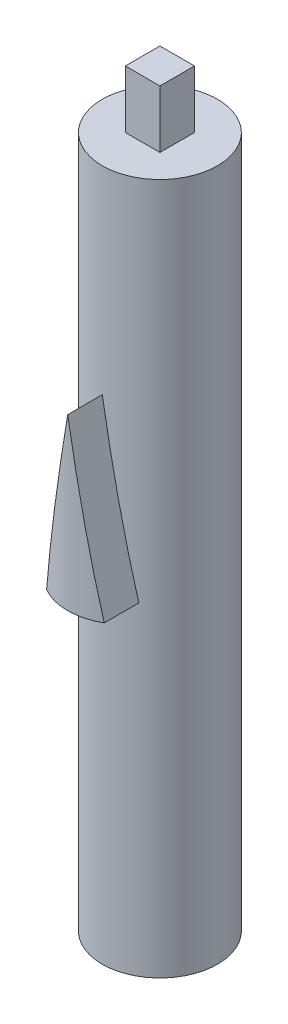
ISO-10303-21;
HEADER;
FILE_DESCRIPTION(('STEP AP214'),'2;1');
FILE_NAME('part.step','',(''),(''),'','','');
FILE_SCHEMA(('AUTOMOTIVE_DESIGN { 1 0 10303 214 1 1 1 1 }'));
ENDSEC;
DATA;
#1=APPLICATION_CONTEXT('core data for automotive mechanical design processes');
#2=APPLICATION_PROTOCOL_DEFINITION('international standard','automotive_design',2000,#1);
#3=PRODUCT_CONTEXT('',#1,'mechanical');
#4=PRODUCT('Part','Part','',(#3));
#5=PRODUCT_RELATED_PRODUCT_CATEGORY('part','',(#4));
#6=PRODUCT_DEFINITION_FORMATION('','',#4);
#7=PRODUCT_DEFINITION_CONTEXT('part definition',#1,'design');
#8=PRODUCT_DEFINITION('design','',#6,#7);
#9=PRODUCT_DEFINITION_SHAPE('','',#8);
#10=(LENGTH_UNIT() NAMED_UNIT(*) SI_UNIT(.MILLI.,.METRE.));
#11=(NAMED_UNIT(*) PLANE_ANGLE_UNIT() SI_UNIT($,.RADIAN.));
#12=(NAMED_UNIT(*) SI_UNIT($,.STERADIAN.) SOLID_ANGLE_UNIT());
#13=UNCERTAINTY_MEASURE_WITH_UNIT(LENGTH_MEASURE(1.E-05),#10,'distance_accuracy_value','');
#14=(GEOMETRIC_REPRESENTATION_CONTEXT(3) GLOBAL_UNCERTAINTY_ASSIGNED_CONTEXT((#13)) GLOBAL_UNIT_ASSIGNED_CONTEXT((#10,
#11,#12)) REPRESENTATION_CONTEXT('',''));
#15=CARTESIAN_POINT('',(0.,0.,0.));
#16=DIRECTION('',(0.,0.,1.));
#17=DIRECTION('',(1.,0.,0.));
#18=AXIS2_PLACEMENT_3D('',#15,#16,#17);
#19=CARTESIAN_POINT('',(0.,60.,0.));
#20=DIRECTION('',(0.,1.,0.));
#21=DIRECTION('',(0.,0.,1.));
#22=AXIS2_PLACEMENT_3D('',#19,#20,#21);
#23=PLANE('',#22);
#24=CARTESIAN_POINT('',(0.,60.,0.));
#25=DIRECTION('',(0.,1.,0.));
#26=DIRECTION('',(0.,0.,1.));
#27=AXIS2_PLACEMENT_3D('',#24,#25,#26);
#28=CIRCLE('',#27,5.);
#29=CARTESIAN_POINT('',(0.,60.,5.));
#30=VERTEX_POINT('',#29);
#31=EDGE_CURVE('E11',#30,#30,#28,.T.);
#32=ORIENTED_EDGE('',*,*,#31,.T.);
#33=EDGE_LOOP('',(#32));
#34=FACE_BOUND('',#33,.T.);
#35=DIRECTION('',(1.,0.,0.));
#36=VECTOR('',#35,1.);
#37=CARTESIAN_POINT('',(-1.5,60.,1.5));
#38=LINE('',#37,#36);
#39=CARTESIAN_POINT('',(-1.5,60.,1.5));
#40=VERTEX_POINT('',#39);
#41=CARTESIAN_POINT('',(1.5,60.,1.5));
#42=VERTEX_POINT('',#41);
#43=EDGE_CURVE('E454',#40,#42,#38,.T.);
#44=ORIENTED_EDGE('',*,*,#43,.F.);
#45=DIRECTION('',(0.,0.,1.));
#46=VECTOR('',#45,1.);
#47=CARTESIAN_POINT('',(-1.5,60.,-1.5));
#48=LINE('',#47,#46);
#49=CARTESIAN_POINT('',(-1.5,60.,-1.5));
#50=VERTEX_POINT('',#49);
#51=EDGE_CURVE('E144',#50,#40,#48,.T.);
#52=ORIENTED_EDGE('',*,*,#51,.F.);
#53=DIRECTION('',(-1.,0.,0.));
#54=VECTOR('',#53,1.);
#55=CARTESIAN_POINT('',(-1.5,60.,-1.5));
#56=LINE('',#55,#54);
#57=CARTESIAN_POINT('',(1.5,60.,-1.5));
#58=VERTEX_POINT('',#57);
#59=EDGE_CURVE('E140',#58,#50,#56,.T.);
#60=ORIENTED_EDGE('',*,*,#59,.F.);
#61=DIRECTION('',(0.,0.,-1.));
#62=VECTOR('',#61,1.);
#63=CARTESIAN_POINT('',(1.5,60.,-1.5));
#64=LINE('',#63,#62);
#65=EDGE_CURVE('E451',#42,#58,#64,.T.);
#66=ORIENTED_EDGE('',*,*,#65,.F.);
#67=EDGE_LOOP('',(#44,#52,#60,#66));
#68=FACE_BOUND('',#67,.T.);
#69=ADVANCED_FACE('F33',(#34,#68),#23,.T.);
#70=CARTESIAN_POINT('',(0.,60.,0.));
#71=DIRECTION('',(0.,-1.,0.));
#72=DIRECTION('',(0.,0.,-1.));
#73=AXIS2_PLACEMENT_3D('',#70,#71,#72);
#74=CYLINDRICAL_SURFACE('',#73,5.);
#75=CARTESIAN_POINT('',(2.5,28.0658588516965,4.3301270189222));
#76=CARTESIAN_POINT('',(2.21745255142468,29.730894238097,4.493255864416));
#77=CARTESIAN_POINT('',(1.91601823639988,31.5072288102985,4.61831940404549));
#78=CARTESIAN_POINT('',(1.6120982113092,33.2982115247533,4.74441425193631));
#79=CARTESIAN_POINT('',(1.2940952255126,35.1721842928747,4.82962913144534));
#80=CARTESIAN_POINT('',(0.976268591219955,37.0451178320242,4.91479675425292));
#81=CARTESIAN_POINT('',(0.649839235186189,38.968746701075,4.95759104489395));
#82=CARTESIAN_POINT('',(0.326349169152357,40.8750545081751,5.));
#83=CARTESIAN_POINT('',(0.,42.7982108406813,5.));
#84=B_SPLINE_CURVE_WITH_KNOTS('',2,(#75,#76,#77,#78,#79,#80,#81,#82,#83),.UNSPECIFIED.,.F.,.F.,
(3,2,2,2,3),(0.,0.25,0.5,0.75,1.),.UNSPECIFIED.);
#85=CARTESIAN_POINT('',(2.5,28.0658588516965,4.33012701892219));
#86=VERTEX_POINT('',#85);
#87=CARTESIAN_POINT('',(0.,42.7982108406813,5.));
#88=VERTEX_POINT('',#87);
#89=EDGE_CURVE('E171',#86,#88,#84,.T.);
#90=ORIENTED_EDGE('',*,*,#89,.F.);
#91=CARTESIAN_POINT('',(0.,28.0658588516965,0.));
#92=DIRECTION('',(0.,1.,0.));
#93=DIRECTION('',(0.,0.,1.));
#94=AXIS2_PLACEMENT_3D('',#91,#92,#93);
#95=CIRCLE('',#94,5.);
#96=CARTESIAN_POINT('',(-2.5,28.0658588516965,4.3301270189222));
#97=VERTEX_POINT('',#96);
#98=EDGE_CURVE('E60',#97,#86,#95,.T.);
#99=ORIENTED_EDGE('',*,*,#98,.F.);
#100=CARTESIAN_POINT('',(0.,42.7982108406813,5.));
#101=CARTESIAN_POINT('',(-0.326257690966926,40.875593583706,5.));
#102=CARTESIAN_POINT('',(-0.649839235186196,38.968746701075,4.95759104489394));
#103=CARTESIAN_POINT('',(-0.976089121549473,37.046175436167,4.91483237391498));
#104=CARTESIAN_POINT('',(-1.29409522551261,35.1721842928747,4.82962913144534));
#105=CARTESIAN_POINT('',(-1.61192497621431,33.2992323889112,4.7444731392313));
#106=CARTESIAN_POINT('',(-1.91601823639988,31.5072288102985,4.61831940404549));
#107=CARTESIAN_POINT('',(-2.21737332901909,29.7313610910428,4.49330160349319));
#108=CARTESIAN_POINT('',(-2.5,28.0658588516965,4.3301270189222));
#109=B_SPLINE_CURVE_WITH_KNOTS('',2,(#100,#101,#102,#103,#104,#105,#106,#107,#108),
.UNSPECIFIED.,.F.,.F.,(3,2,2,2,3),(0.,0.25,0.5,0.75,1.),.UNSPECIFIED.);
#110=EDGE_CURVE('E164',#88,#97,#109,.T.);
#111=ORIENTED_EDGE('',*,*,#110,.F.);
#112=EDGE_LOOP('',(#90,#99,#111));
#113=FACE_BOUND('',#112,.T.);
#114=ORIENTED_EDGE('',*,*,#31,.F.);
#115=EDGE_LOOP('',(#114));
#116=FACE_BOUND('',#115,.T.);
#117=CARTESIAN_POINT('',(0.,0.,0.));
#118=DIRECTION('',(0.,1.,0.));
#119=DIRECTION('',(0.,0.,1.));
#120=AXIS2_PLACEMENT_3D('',#117,#118,#119);
#121=CIRCLE('',#120,5.);
#122=CARTESIAN_POINT('',(0.,0.,5.));
#123=VERTEX_POINT('',#122);
#124=EDGE_CURVE('E44',#123,#123,#121,.T.);
#125=ORIENTED_EDGE('',*,*,#124,.T.);
#126=EDGE_LOOP('',(#125));
#127=FACE_BOUND('',#126,.T.);
#128=ADVANCED_FACE('F35',(#113,#116,#127),#74,.T.);
#129=CARTESIAN_POINT('',(0.,0.,0.));
#130=DIRECTION('',(0.,1.,0.));
#131=DIRECTION('',(0.,0.,1.));
#132=AXIS2_PLACEMENT_3D('',#129,#130,#131);
#133=PLANE('',#132);
#134=DIRECTION('',(1.,0.,0.));
#135=VECTOR('',#134,1.);
#136=CARTESIAN_POINT('',(-2.5,0.,-1.5));
#137=LINE('',#136,#135);
#138=CARTESIAN_POINT('',(-2.5,0.,-1.5));
#139=VERTEX_POINT('',#138);
#140=CARTESIAN_POINT('',(2.5,0.,-1.5));
#141=VERTEX_POINT('',#140);
#142=EDGE_CURVE('E273',#139,#141,#137,.T.);
#143=ORIENTED_EDGE('',*,*,#142,.F.);
#144=DIRECTION('',(0.,0.,-1.));
#145=VECTOR('',#144,1.);
#146=CARTESIAN_POINT('',(-2.5,0.,1.5));
#147=LINE('',#146,#145);
#148=CARTESIAN_POINT('',(-2.5,0.,1.5));
#149=VERTEX_POINT('',#148);
#150=EDGE_CURVE('E244',#149,#139,#147,.T.);
#151=ORIENTED_EDGE('',*,*,#150,.F.);
#152=DIRECTION('',(-1.,0.,0.));
#153=VECTOR('',#152,1.);
#154=CARTESIAN_POINT('',(-2.5,0.,1.5));
#155=LINE('',#154,#153);
#156=CARTESIAN_POINT('',(2.5,0.,1.5));
#157=VERTEX_POINT('',#156);
#158=EDGE_CURVE('E266',#157,#149,#155,.T.);
#159=ORIENTED_EDGE('',*,*,#158,.F.);
#160=DIRECTION('',(0.,0.,1.));
#161=VECTOR('',#160,1.);
#162=CARTESIAN_POINT('',(2.5,0.,1.5));
#163=LINE('',#162,#161);
#164=EDGE_CURVE('E270',#141,#157,#163,.T.);
#165=ORIENTED_EDGE('',*,*,#164,.F.);
#166=EDGE_LOOP('',(#143,#151,#159,#165));
#167=FACE_BOUND('',#166,.T.);
#168=ORIENTED_EDGE('',*,*,#124,.F.);
#169=EDGE_LOOP('',(#168));
#170=FACE_BOUND('',#169,.T.);
#171=ADVANCED_FACE('F311',(#167,#170),#133,.F.);
#172=CARTESIAN_POINT('',(-2.5,6.,1.5));
#173=DIRECTION('',(-1.,0.,0.));
#174=DIRECTION('',(0.,0.,1.));
#175=AXIS2_PLACEMENT_3D('',#172,#173,#174);
#176=PLANE('',#175);
#177=ORIENTED_EDGE('',*,*,#150,.T.);
#178=DIRECTION('',(0.,-1.,0.));
#179=VECTOR('',#178,1.);
#180=CARTESIAN_POINT('',(-2.5,6.,-1.5));
#181=LINE('',#180,#179);
#182=CARTESIAN_POINT('',(-2.5,6.,-1.5));
#183=VERTEX_POINT('',#182);
#184=EDGE_CURVE('E257',#183,#139,#181,.T.);
#185=ORIENTED_EDGE('',*,*,#184,.F.);
#186=DIRECTION('',(0.,0.,-1.));
#187=VECTOR('',#186,1.);
#188=CARTESIAN_POINT('',(-2.5,6.,1.5));
#189=LINE('',#188,#187);
#190=CARTESIAN_POINT('',(-2.5,6.,1.5));
#191=VERTEX_POINT('',#190);
#192=EDGE_CURVE('E269',#191,#183,#189,.T.);
#193=ORIENTED_EDGE('',*,*,#192,.F.);
#194=DIRECTION('',(0.,-1.,0.));
#195=VECTOR('',#194,1.);
#196=CARTESIAN_POINT('',(-2.5,6.,1.5));
#197=LINE('',#196,#195);
#198=EDGE_CURVE('E255',#191,#149,#197,.T.);
#199=ORIENTED_EDGE('',*,*,#198,.T.);
#200=EDGE_LOOP('',(#177,#185,#193,#199));
#201=FACE_BOUND('',#200,.T.);
#202=ADVANCED_FACE('F298',(#201),#176,.F.);
#203=CARTESIAN_POINT('',(-2.5,6.,1.5));
#204=DIRECTION('',(0.,0.,1.));
#205=DIRECTION('',(1.,0.,0.));
#206=AXIS2_PLACEMENT_3D('',#203,#204,#205);
#207=PLANE('',#206);
#208=ORIENTED_EDGE('',*,*,#158,.T.);
#209=ORIENTED_EDGE('',*,*,#198,.F.);
#210=DIRECTION('',(-1.,0.,0.));
#211=VECTOR('',#210,1.);
#212=CARTESIAN_POINT('',(-2.5,6.,1.5));
#213=LINE('',#212,#211);
#214=CARTESIAN_POINT('',(2.5,6.,1.5));
#215=VERTEX_POINT('',#214);
#216=EDGE_CURVE('E261',#215,#191,#213,.T.);
#217=ORIENTED_EDGE('',*,*,#216,.F.);
#218=DIRECTION('',(0.,-1.,0.));
#219=VECTOR('',#218,1.);
#220=CARTESIAN_POINT('',(2.5,6.,1.5));
#221=LINE('',#220,#219);
#222=EDGE_CURVE('E263',#215,#157,#221,.T.);
#223=ORIENTED_EDGE('',*,*,#222,.T.);
#224=EDGE_LOOP('',(#208,#209,#217,#223));
#225=FACE_BOUND('',#224,.T.);
#226=ADVANCED_FACE('F308',(#225),#207,.F.);
#227=CARTESIAN_POINT('',(2.5,6.,1.5));
#228=DIRECTION('',(1.,0.,0.));
#229=DIRECTION('',(0.,0.,-1.));
#230=AXIS2_PLACEMENT_3D('',#227,#228,#229);
#231=PLANE('',#230);
#232=ORIENTED_EDGE('',*,*,#164,.T.);
#233=ORIENTED_EDGE('',*,*,#222,.F.);
#234=DIRECTION('',(0.,0.,1.));
#235=VECTOR('',#234,1.);
#236=CARTESIAN_POINT('',(2.5,6.,1.5));
#237=LINE('',#236,#235);
#238=CARTESIAN_POINT('',(2.5,6.,-1.5));
#239=VERTEX_POINT('',#238);
#240=EDGE_CURVE('E279',#239,#215,#237,.T.);
#241=ORIENTED_EDGE('',*,*,#240,.F.);
#242=DIRECTION('',(0.,-1.,0.));
#243=VECTOR('',#242,1.);
#244=CARTESIAN_POINT('',(2.5,6.,-1.5));
#245=LINE('',#244,#243);
#246=EDGE_CURVE('E260',#239,#141,#245,.T.);
#247=ORIENTED_EDGE('',*,*,#246,.T.);
#248=EDGE_LOOP('',(#232,#233,#241,#247));
#249=FACE_BOUND('',#248,.T.);
#250=ADVANCED_FACE('F306',(#249),#231,.F.);
#251=CARTESIAN_POINT('',(-2.5,6.,-1.5));
#252=DIRECTION('',(0.,0.,-1.));
#253=DIRECTION('',(-1.,0.,0.));
#254=AXIS2_PLACEMENT_3D('',#251,#252,#253);
#255=PLANE('',#254);
#256=ORIENTED_EDGE('',*,*,#142,.T.);
#257=ORIENTED_EDGE('',*,*,#246,.F.);
#258=DIRECTION('',(1.,0.,0.));
#259=VECTOR('',#258,1.);
#260=CARTESIAN_POINT('',(-2.5,6.,-1.5));
#261=LINE('',#260,#259);
#262=EDGE_CURVE('E282',#183,#239,#261,.T.);
#263=ORIENTED_EDGE('',*,*,#262,.F.);
#264=ORIENTED_EDGE('',*,*,#184,.T.);
#265=EDGE_LOOP('',(#256,#257,#263,#264));
#266=FACE_BOUND('',#265,.T.);
#267=ADVANCED_FACE('F302',(#266),#255,.F.);
#268=CARTESIAN_POINT('',(0.,6.,0.));
#269=DIRECTION('',(0.,-1.,0.));
#270=DIRECTION('',(0.,0.,-1.));
#271=AXIS2_PLACEMENT_3D('',#268,#269,#270);
#272=PLANE('',#271);
#273=ORIENTED_EDGE('',*,*,#192,.T.);
#274=ORIENTED_EDGE('',*,*,#262,.T.);
#275=ORIENTED_EDGE('',*,*,#240,.T.);
#276=ORIENTED_EDGE('',*,*,#216,.T.);
#277=EDGE_LOOP('',(#273,#274,#275,#276));
#278=FACE_BOUND('',#277,.T.);
#279=ADVANCED_FACE('F191',(#278),#272,.T.);
#280=CARTESIAN_POINT('',(0.,60.,3.));
#281=DIRECTION('',(0.,-1.,0.));
#282=DIRECTION('',(0.,0.,-1.));
#283=AXIS2_PLACEMENT_3D('',#280,#281,#282);
#284=CYLINDRICAL_SURFACE('',#283,5.);
#285=CARTESIAN_POINT('',(0.,28.0658588516965,3.));
#286=DIRECTION('',(0.,1.,0.));
#287=DIRECTION('',(0.,0.,1.));
#288=AXIS2_PLACEMENT_3D('',#285,#286,#287);
#289=CIRCLE('',#288,5.);
#290=CARTESIAN_POINT('',(-2.5,28.0658588516965,7.3301270189222));
#291=VERTEX_POINT('',#290);
#292=CARTESIAN_POINT('',(2.5,28.0658588516965,7.3301270189222));
#293=VERTEX_POINT('',#292);
#294=EDGE_CURVE('E146',#291,#293,#289,.T.);
#295=ORIENTED_EDGE('',*,*,#294,.T.);
#296=CARTESIAN_POINT('',(2.5,28.0658588516965,7.3301270189222));
#297=CARTESIAN_POINT('',(2.47941253575893,28.1871798229646,7.34201309342846));
#298=CARTESIAN_POINT('',(2.45882205338944,28.3085192438451,7.35370534923572));
#299=CARTESIAN_POINT('',(2.4172864306208,28.5532881278564,7.3769055240065));
#300=CARTESIAN_POINT('',(2.39634118911194,28.6767181876298,7.38840696830534));
#301=CARTESIAN_POINT('',(2.35409582142376,28.9256683295189,7.41121508970024));
#302=CARTESIAN_POINT('',(2.3327955944671,29.0511889837165,7.42251533283251));
#303=CARTESIAN_POINT('',(2.28984031295704,29.3043203748259,7.44491030390534));
#304=CARTESIAN_POINT('',(2.26818516255557,29.4319316619826,7.45599863144819));
#305=CARTESIAN_POINT('',(2.23556746259739,29.6241445146343,7.47240300129552));
#306=CARTESIAN_POINT('',(2.2246069164348,29.6887340107332,7.47786483776448));
#307=CARTESIAN_POINT('',(2.20300420294405,29.8160374788601,7.48853131133486));
#308=CARTESIAN_POINT('',(2.19236207193872,29.8787512177903,7.49373880405637));
#309=CARTESIAN_POINT('',(2.16015187595629,30.0685653171826,7.50935898362797));
#310=CARTESIAN_POINT('',(2.13858192659474,30.1956772347033,7.51962768084121));
#311=CARTESIAN_POINT('',(2.09506087879823,30.4521461316719,7.53996771676744));
#312=CARTESIAN_POINT('',(2.07310969157232,30.5815036160038,7.55003249347359));
#313=CARTESIAN_POINT('',(2.02882609188557,30.8424636953908,7.56995232003373));
#314=CARTESIAN_POINT('',(2.00649359290338,30.9740667757279,7.57980082003483));
#315=CARTESIAN_POINT('',(1.96144753538125,31.2395180567004,7.59927556979917));
#316=CARTESIAN_POINT('',(1.93873389652408,31.3733667234959,7.60889527867775));
#317=CARTESIAN_POINT('',(1.89400190807835,31.6369697747582,7.62745339518222));
#318=CARTESIAN_POINT('',(1.87198368102884,31.7667233456388,7.63640366003135));
#319=CARTESIAN_POINT('',(1.82752813576581,32.0287000784553,7.65410830201351));
#320=CARTESIAN_POINT('',(1.80509074059346,32.16092369172,7.66285580729153));
#321=CARTESIAN_POINT('',(1.75979657139831,32.4278405149397,7.6801404278641));
#322=CARTESIAN_POINT('',(1.7369397183462,32.5625341572453,7.6886706567451));
#323=CARTESIAN_POINT('',(1.69080670884013,32.8343910833861,7.70550597702193));
#324=CARTESIAN_POINT('',(1.66753047797429,32.9715547824631,7.71380416381042));
#325=CARTESIAN_POINT('',(1.63245770689733,33.1782346970137,7.72601711911607));
#326=CARTESIAN_POINT('',(1.62066249127828,33.2477427171218,7.73007487202118));
#327=CARTESIAN_POINT('',(1.59768742332133,33.383133457331,7.73788289354918));
#328=CARTESIAN_POINT('',(1.58650761005545,33.4490158963108,7.74163815217048));
#329=CARTESIAN_POINT('',(1.55261078719356,33.6487699036532,7.75289098116345));
#330=CARTESIAN_POINT('',(1.52989261079474,33.7826490067251,7.76025171508395));
#331=CARTESIAN_POINT('',(1.48397773885674,34.0532255186194,7.7747672027494));
#332=CARTESIAN_POINT('',(1.46078097118343,34.1899233185233,7.78191443039262));
#333=CARTESIAN_POINT('',(1.41390881568155,34.4661372672214,7.79598507187347));
#334=CARTESIAN_POINT('',(1.39023335688451,34.6056537903101,7.80290090233081));
#335=CARTESIAN_POINT('',(1.3424040660599,34.8875051905282,7.81649060433864));
#336=CARTESIAN_POINT('',(1.31825017112739,35.0298404255082,7.82315683244193));
#337=CARTESIAN_POINT('',(1.27137620270233,35.3060663401033,7.83571667604339));
#338=CARTESIAN_POINT('',(1.24865625041522,35.4399560238969,7.84163266296766));
#339=CARTESIAN_POINT('',(1.20263865783888,35.7111395215731,7.85327082415921));
#340=CARTESIAN_POINT('',(1.17934095507996,35.8484336982539,7.85898429939213));
#341=CARTESIAN_POINT('',(1.13216739927169,36.1264261826525,7.87019498137453));
#342=CARTESIAN_POINT('',(1.10829147562598,36.2671248340754,7.87568336402288));
#343=CARTESIAN_POINT('',(1.05996161499948,36.5519263139748,7.88642086009429));
#344=CARTESIAN_POINT('',(1.03550761430968,36.6960294696119,7.89166102026841));
#345=CARTESIAN_POINT('',(0.998609372754734,36.9134656183961,7.8992796153143));
#346=CARTESIAN_POINT('',(0.986165843126588,36.9867938039816,7.90179945305964));
#347=CARTESIAN_POINT('',(0.962493507031099,37.1262936855257,7.90649949585667));
#348=CARTESIAN_POINT('',(0.951264723571009,37.1924650775621,7.90868883993212));
#349=CARTESIAN_POINT('',(0.917004185513706,37.3943640873714,7.91524701625523));
#350=CARTESIAN_POINT('',(0.893971939061585,37.5300957987147,7.91948791198631));
#351=CARTESIAN_POINT('',(0.847140275060569,37.8060772358727,7.9277720551714));
#352=CARTESIAN_POINT('',(0.823340785412489,37.9463272864627,7.93180405935477));
#353=CARTESIAN_POINT('',(0.774974489537245,38.2313454532757,7.93963904096772));
#354=CARTESIAN_POINT('',(0.750407611294522,38.3761138743012,7.94343048920128));
#355=CARTESIAN_POINT('',(0.700506873719043,38.6701687691784,7.95075203156907));
#356=CARTESIAN_POINT('',(0.675172957415638,38.8194555277988,7.95427030774912));
#357=CARTESIAN_POINT('',(0.62789038818693,39.0980908649882,7.96046809355093));
#358=CARTESIAN_POINT('',(0.605941686865234,39.2274383426707,7.96319686365404));
#359=CARTESIAN_POINT('',(0.560818713601088,39.4933555266564,7.96850347856787));
#360=CARTESIAN_POINT('',(0.537644383423495,39.6299255610772,7.97106440971217));
#361=CARTESIAN_POINT('',(0.490069063366615,39.910287853515,7.97598573525795));
#362=CARTESIAN_POINT('',(0.465667963930515,40.0540804042747,7.97832838189561));
#363=CARTESIAN_POINT('',(0.415639353094415,40.3488877888365,7.98276086198336));
#364=CARTESIAN_POINT('',(0.390011755627834,40.499902888632,7.98483210540862));
#365=CARTESIAN_POINT('',(0.351111084953791,40.7291357153436,7.98767462019655));
#366=CARTESIAN_POINT('',(0.337838000880563,40.8073516638524,7.98859122415871));
#367=CARTESIAN_POINT('',(0.313578293499259,40.9503123891522,7.9901693231328));
#368=CARTESIAN_POINT('',(0.302591628459066,41.0150569745036,7.99084756528559));
#369=CARTESIAN_POINT('',(0.267831300634358,41.2198996118752,7.9928782802856));
#370=CARTESIAN_POINT('',(0.244057316711018,41.3599989664426,7.99409675468907));
#371=CARTESIAN_POINT('',(0.200876854715766,41.614456936932,7.99600097857284));
#372=CARTESIAN_POINT('',(0.181470541201089,41.7288151639968,7.99674347536845));
#373=CARTESIAN_POINT('',(0.136502791394053,41.9938086591474,7.99820179407383));
#374=CARTESIAN_POINT('',(0.110941587501162,42.1444444326406,7.99883444333996));
#375=CARTESIAN_POINT('',(0.056921000756747,42.4627904573586,7.99975698215332));
#376=CARTESIAN_POINT('',(0.0284615036509577,42.6305008266433,7.99999989511112));
#377=CARTESIAN_POINT('',(0.,42.7982108406813,8.));
#378=B_SPLINE_CURVE_WITH_KNOTS('',3,(#296,#297,#298,#299,#300,#301,#302,#303,#304,#305,#306,
#307,#308,#309,#310,#311,#312,#313,#314,#315,#316,#317,#318,#319,#320,#321,#322,#323,#324,#325,
#326,#327,#328,#329,#330,#331,#332,#333,#334,#335,#336,#337,#338,#339,#340,#341,#342,#343,#344,
#345,#346,#347,#348,#349,#350,#351,#352,#353,#354,#355,#356,#357,#358,#359,#360,#361,#362,#363,
#364,#365,#366,#367,#368,#369,#370,#371,#372,#373,#374,#375,#376,#377),.UNSPECIFIED.,.F.,.F.,(4,
2,2,2,2,2,2,2,2,2,2,2,2,2,2,2,2,2,2,2,2,2,2,2,2,2,2,2,2,2,2,2,2,2,2,2,2,2,2,2,4),(0.,
0.370884030139843,0.748048756883886,1.13149499351225,1.52122351397851,1.71844391966494,
1.90991311040439,2.2979245393351,2.69270066164353,3.09424204294658,3.50254922074261,
3.8982861191308,4.30148202070161,4.71213732215316,5.13025239894585,5.34210751660675,
5.54289659391533,5.95087302798007,6.36738083409766,6.79242025923421,7.22599153576575,
7.63378859225613,8.05191019779204,8.48035650093959,8.91912763975343,9.14238511207989,
9.34384421700683,9.75705571143032,10.1839917440607,10.6246523848011,11.0790376971553,
11.4727119314129,11.8883494082103,12.3259501524746,12.7855141852694,13.0235324941284,
13.2205534090441,13.6468751737941,13.9948615360145,14.4532322703634,14.9635558925776),.UNSPECIFIED.);
#379=CARTESIAN_POINT('',(0.,42.7982108406813,8.));
#380=VERTEX_POINT('',#379);
#381=EDGE_CURVE('E238',#293,#380,#378,.T.);
#382=ORIENTED_EDGE('',*,*,#381,.T.);
#383=CARTESIAN_POINT('',(0.,42.7982108406813,8.));
#384=CARTESIAN_POINT('',(-0.0284594057364607,42.6305114029096,7.99999992639222));
#385=CARTESIAN_POINT('',(-0.0569172588741277,42.46281167726,7.99975702749257));
#386=CARTESIAN_POINT('',(-0.106714981393496,42.1693526646588,7.99890663730553));
#387=CARTESIAN_POINT('',(-0.128055119029872,42.0435931069946,7.99840551710532));
#388=CARTESIAN_POINT('',(-0.153618377501782,41.89294751597,7.99764136779658));
#389=CARTESIAN_POINT('',(-0.157841448805858,41.8680607810431,7.99750977281259));
#390=CARTESIAN_POINT('',(-0.181468087350668,41.7288289819736,7.99674356268083));
#391=CARTESIAN_POINT('',(-0.200872132204608,41.6144845721781,7.99600116130991));
#392=CARTESIAN_POINT('',(-0.24405084136949,41.3600373484153,7.99409707150994));
#393=CARTESIAN_POINT('',(-0.267825318786887,41.2199349237484,7.99287860330023));
#394=CARTESIAN_POINT('',(-0.30258798078065,41.0150784685296,7.99084779060416));
#395=CARTESIAN_POINT('',(-0.313576470472208,40.9503231361279,7.99016944175661));
#396=CARTESIAN_POINT('',(-0.337836957468157,40.8073578077674,7.98859129198999));
#397=CARTESIAN_POINT('',(-0.351108995694687,40.7291480029853,7.98767476446711));
#398=CARTESIAN_POINT('',(-0.390007315271969,40.4999289996037,7.98483244607504));
#399=CARTESIAN_POINT('',(-0.415633611426345,40.3489215797602,7.9827613341637));
#400=CARTESIAN_POINT('',(-0.465660664165381,40.0541234109446,7.97832906341809));
#401=CARTESIAN_POINT('',(-0.490061506653812,39.9103323961981,7.97598647820754));
#402=CARTESIAN_POINT('',(-0.537637355766979,39.6299670319446,7.97106517345656));
#403=CARTESIAN_POINT('',(-0.56081247182867,39.4933923899427,7.96850418676772));
#404=CARTESIAN_POINT('',(-0.605938049359985,39.2274598460669,7.96319731592012));
#405=CARTESIAN_POINT('',(-0.627888569529507,39.0981016164274,7.96046833193796));
#406=CARTESIAN_POINT('',(-0.675171089460569,38.8194664962452,7.95427055260252));
#407=CARTESIAN_POINT('',(-0.700503137494554,38.6701907053787,7.95075255049258));
#408=CARTESIAN_POINT('',(-0.750401215609454,38.376151478871,7.94343145596469));
#409=CARTESIAN_POINT('',(-0.774967302188658,38.2313877588073,7.93964016449557));
#410=CARTESIAN_POINT('',(-0.823333079225404,37.9463727258074,7.93180534718798));
#411=CARTESIAN_POINT('',(-0.847132841567932,37.8061211084936,7.92777333439596));
#412=CARTESIAN_POINT('',(-0.893966109864017,37.5301302701774,7.91948897766853));
#413=CARTESIAN_POINT('',(-0.916999687956883,37.3943907248671,7.91524786172997));
#414=CARTESIAN_POINT('',(-0.951262608212585,37.1924776125732,7.90868925238682));
#415=CARTESIAN_POINT('',(-0.962492449395751,37.1262999529121,7.90649970584547));
#416=CARTESIAN_POINT('',(-0.986164777611101,36.986800044458,7.90179966461354));
#417=CARTESIAN_POINT('',(-0.998607241660599,36.9134780990531,7.89928004687824));
#418=CARTESIAN_POINT('',(-1.03550308912489,36.6960559903978,7.8916619712253));
#419=CARTESIAN_POINT('',(-1.05995576903657,36.5519606356287,7.88642212122251));
#420=CARTESIAN_POINT('',(-1.10828405383765,36.2671685162831,7.87568504970892));
#421=CARTESIAN_POINT('',(-1.13215972216454,36.1264714251341,7.87019676470575));
#422=CARTESIAN_POINT('',(-1.17933382609194,35.8484758207521,7.85898603369153));
#423=CARTESIAN_POINT('',(-1.2026323321594,35.7111769644452,7.85327239563846));
#424=CARTESIAN_POINT('',(-1.24865256870838,35.4399778651706,7.84163362171958));
#425=CARTESIAN_POINT('',(-1.27137436206649,35.3060772601476,7.83571716923747));
#426=CARTESIAN_POINT('',(-1.31824833227309,35.0298511838936,7.82315732516457));
#427=CARTESIAN_POINT('',(-1.34240038818972,34.8875267059258,7.81649161949388));
#428=CARTESIAN_POINT('',(-1.39022706924861,34.605690673144,7.80290271807534));
#429=CARTESIAN_POINT('',(-1.41390175667925,34.4661787611998,7.79598714870701));
#430=CARTESIAN_POINT('',(-1.46077341405105,34.1899678862886,7.78191674034475));
#431=CARTESIAN_POINT('',(-1.48397045477598,34.0532685498498,7.77476946800612));
#432=CARTESIAN_POINT('',(-1.52988690766725,33.7826828171767,7.76025355481427));
#433=CARTESIAN_POINT('',(-1.5526063919722,33.6487960307382,7.75289242374219));
#434=CARTESIAN_POINT('',(-1.58650554381326,33.4490281909083,7.74163884623372));
#435=CARTESIAN_POINT('',(-1.59768639027549,33.3831396044104,7.73788324462701));
#436=CARTESIAN_POINT('',(-1.62066146134114,33.2477487238189,7.73007522204318));
#437=CARTESIAN_POINT('',(-1.63245564699355,33.1782467099031,7.72601782778057));
#438=CARTESIAN_POINT('',(-1.66752610604255,32.9715803087862,7.71380570322436));
#439=CARTESIAN_POINT('',(-1.69080106732042,32.83442411855,7.70550799697855));
#440=CARTESIAN_POINT('',(-1.73693256743524,32.5625762021901,7.68867330442827));
#441=CARTESIAN_POINT('',(-1.75978918032063,32.4278840618253,7.68014320561398));
#442=CARTESIAN_POINT('',(-1.80508388795846,32.1609642356668,7.66285846426889));
#443=CARTESIAN_POINT('',(-1.82752206155179,32.028736118582,7.65411069131933));
#444=CARTESIAN_POINT('',(-1.87198015045842,31.7667443684,7.63640509532228));
#445=CARTESIAN_POINT('',(-1.89400014313031,31.6369802851735,7.62745412740858));
#446=CARTESIAN_POINT('',(-1.9387321475756,31.3733769168059,7.60889600427405));
#447=CARTESIAN_POINT('',(-1.9614440374019,31.2395384411572,7.59927705142319));
#448=CARTESIAN_POINT('',(-2.00648762093764,30.9741017193896,7.57980343203611));
#449=CARTESIAN_POINT('',(-2.02881939417985,30.8425030082486,7.56995528908043));
#450=CARTESIAN_POINT('',(-2.07310253277077,30.5815458411964,7.55003575666707));
#451=CARTESIAN_POINT('',(-2.09505398438014,30.4521869012786,7.53997089979494));
#452=CARTESIAN_POINT('',(-2.13857653729491,30.1957092682215,7.51963023806285));
#453=CARTESIAN_POINT('',(-2.16014772735543,30.0685900715495,7.50936097809684));
#454=CARTESIAN_POINT('',(-2.1923601230095,29.8787628662277,7.49373975775222));
#455=CARTESIAN_POINT('',(-2.20300322905427,29.8160433028429,7.48853179219916));
#456=CARTESIAN_POINT('',(-2.2246064516454,29.68873666226,7.47786506725693));
#457=CARTESIAN_POINT('',(-2.23556653196838,29.6241498171023,7.47240346506628));
#458=CARTESIAN_POINT('',(-2.26818318479044,29.431942928198,7.45599963455866));
#459=CARTESIAN_POINT('',(-2.28983776573342,29.304334955791,7.44491161258203));
#460=CARTESIAN_POINT('',(-2.33279237299275,29.0512075418426,7.42251703138334));
#461=CARTESIAN_POINT('',(-2.35409249480728,28.9256875507277,7.41121686431285));
#462=CARTESIAN_POINT('',(-2.39633810858918,28.6767360831308,7.38840865253292));
#463=CARTESIAN_POINT('',(-2.41728370110192,28.5533040352803,7.37690703357471));
#464=CARTESIAN_POINT('',(-2.45882047042389,28.3085285229971,7.35370624819457));
#465=CARTESIAN_POINT('',(-2.47941174829951,28.187184462695,7.34201354820962));
#466=CARTESIAN_POINT('',(-2.5,28.0658588516965,7.3301270189222));
#467=B_SPLINE_CURVE_WITH_KNOTS('',3,(#383,#384,#385,#386,#387,#388,#389,#390,#391,#392,#393,
#394,#395,#396,#397,#398,#399,#400,#401,#402,#403,#404,#405,#406,#407,#408,#409,#410,#411,#412,
#413,#414,#415,#416,#417,#418,#419,#420,#421,#422,#423,#424,#425,#426,#427,#428,#429,#430,#431,
#432,#433,#434,#435,#436,#437,#438,#439,#440,#441,#442,#443,#444,#445,#446,#447,#448,#449,#450,
#451,#452,#453,#454,#455,#456,#457,#458,#459,#460,#461,#462,#463,#464,#465,#466),.UNSPECIFIED.,
.F.,.F.,(4,2,2,2,2,2,2,2,2,2,2,2,2,2,2,2,2,2,2,2,2,2,2,2,2,2,2,2,2,2,2,2,2,2,2,2,2,2,2,2,2,4),
(0.,0.510291295430445,0.892965873944815,0.968694408713294,1.31663872427681,1.74296983272611,
1.94002345060751,2.17802306213238,2.63756372327286,3.07515979320585,3.49081129299778,
3.88451824757488,4.33887017275745,4.77951650470713,5.20645730693471,5.61969264934133,
5.82117083266031,6.04440930203416,6.4831566871639,6.91159823957355,7.32973409732189,
7.73756440895922,8.17110290895963,8.59612828700229,9.01264077548505,9.42064062136436,
9.6214484281203,9.83328523261277,10.251377417937,10.6620281410919,11.0652377775486,
11.4610067239625,11.8692827987751,12.2708108502068,12.6655914158069,13.0536250611706,
13.2451120250338,13.4423243257075,13.8320427148573,14.2154869252098,14.5926577308075,
14.9635559449713),.UNSPECIFIED.);
#468=EDGE_CURVE('E155',#380,#291,#467,.T.);
#469=ORIENTED_EDGE('',*,*,#468,.T.);
#470=EDGE_LOOP('',(#295,#382,#469));
#471=FACE_BOUND('',#470,.T.);
#472=ADVANCED_FACE('F194',(#471),#284,.T.);
#473=CARTESIAN_POINT('',(2.5,28.0658588516965,4.3301270189222));
#474=DIRECTION('',(0.,-1.,0.));
#475=DIRECTION('',(1.,0.,0.));
#476=AXIS2_PLACEMENT_3D('',#473,#474,#475);
#477=PLANE('',#476);
#478=ORIENTED_EDGE('',*,*,#294,.F.);
#479=DIRECTION('',(0.,0.,1.));
#480=VECTOR('',#479,1.);
#481=CARTESIAN_POINT('',(-2.5,28.0658588516965,4.3301270189222));
#482=LINE('',#481,#480);
#483=EDGE_CURVE('E148',#97,#291,#482,.T.);
#484=ORIENTED_EDGE('',*,*,#483,.F.);
#485=ORIENTED_EDGE('',*,*,#98,.T.);
#486=DIRECTION('',(0.,0.,1.));
#487=VECTOR('',#486,1.);
#488=CARTESIAN_POINT('',(2.5,28.0658588516965,4.3301270189222));
#489=LINE('',#488,#487);
#490=EDGE_CURVE('E153',#86,#293,#489,.T.);
#491=ORIENTED_EDGE('',*,*,#490,.T.);
#492=EDGE_LOOP('',(#478,#484,#485,#491));
#493=FACE_BOUND('',#492,.T.);
#494=ADVANCED_FACE('F240',(#493),#477,.T.);
#495=CARTESIAN_POINT('',(-2.5,28.0658588516965,4.3301270189222));
#496=DIRECTION('',(-0.985905558127587,0.167302810655206,0.));
#497=DIRECTION('',(-0.167302810655206,-0.985905558127587,0.));
#498=AXIS2_PLACEMENT_3D('',#495,#496,#497);
#499=PLANE('',#498);
#500=ORIENTED_EDGE('',*,*,#468,.F.);
#501=DIRECTION('',(0.,0.,1.));
#502=VECTOR('',#501,1.);
#503=CARTESIAN_POINT('',(0.,42.7982108406813,5.));
#504=LINE('',#503,#502);
#505=EDGE_CURVE('E161',#88,#380,#504,.T.);
#506=ORIENTED_EDGE('',*,*,#505,.F.);
#507=ORIENTED_EDGE('',*,*,#110,.T.);
#508=ORIENTED_EDGE('',*,*,#483,.T.);
#509=EDGE_LOOP('',(#500,#506,#507,#508));
#510=FACE_BOUND('',#509,.T.);
#511=ADVANCED_FACE('F190',(#510),#499,.T.);
#512=CARTESIAN_POINT('',(0.,42.7982108406813,5.));
#513=DIRECTION('',(0.985905558127587,0.167302810655207,0.));
#514=DIRECTION('',(-0.167302810655207,0.985905558127587,0.));
#515=AXIS2_PLACEMENT_3D('',#512,#513,#514);
#516=PLANE('',#515);
#517=ORIENTED_EDGE('',*,*,#381,.F.);
#518=ORIENTED_EDGE('',*,*,#490,.F.);
#519=ORIENTED_EDGE('',*,*,#89,.T.);
#520=ORIENTED_EDGE('',*,*,#505,.T.);
#521=EDGE_LOOP('',(#517,#518,#519,#520));
#522=FACE_BOUND('',#521,.T.);
#523=ADVANCED_FACE('F181',(#522),#516,.T.);
#524=CARTESIAN_POINT('',(-1.5,65.,-1.5));
#525=DIRECTION('',(1.,0.,0.));
#526=DIRECTION('',(0.,0.,-1.));
#527=AXIS2_PLACEMENT_3D('',#524,#525,#526);
#528=PLANE('',#527);
#529=ORIENTED_EDGE('',*,*,#51,.T.);
#530=DIRECTION('',(0.,-1.,0.));
#531=VECTOR('',#530,1.);
#532=CARTESIAN_POINT('',(-1.5,65.,1.5));
#533=LINE('',#532,#531);
#534=CARTESIAN_POINT('',(-1.5,65.,1.5));
#535=VERTEX_POINT('',#534);
#536=EDGE_CURVE('E125',#535,#40,#533,.T.);
#537=ORIENTED_EDGE('',*,*,#536,.F.);
#538=DIRECTION('',(0.,0.,1.));
#539=VECTOR('',#538,1.);
#540=CARTESIAN_POINT('',(-1.5,65.,-1.5));
#541=LINE('',#540,#539);
#542=CARTESIAN_POINT('',(-1.5,65.,-1.5));
#543=VERTEX_POINT('',#542);
#544=EDGE_CURVE('E132',#543,#535,#541,.T.);
#545=ORIENTED_EDGE('',*,*,#544,.F.);
#546=DIRECTION('',(0.,-1.,0.));
#547=VECTOR('',#546,1.);
#548=CARTESIAN_POINT('',(-1.5,65.,-1.5));
#549=LINE('',#548,#547);
#550=EDGE_CURVE('E449',#543,#50,#549,.T.);
#551=ORIENTED_EDGE('',*,*,#550,.T.);
#552=EDGE_LOOP('',(#529,#537,#545,#551));
#553=FACE_BOUND('',#552,.T.);
#554=ADVANCED_FACE('F142',(#553),#528,.F.);
#555=CARTESIAN_POINT('',(-1.5,65.,1.5));
#556=DIRECTION('',(0.,0.,-1.));
#557=DIRECTION('',(-1.,0.,0.));
#558=AXIS2_PLACEMENT_3D('',#555,#556,#557);
#559=PLANE('',#558);
#560=ORIENTED_EDGE('',*,*,#43,.T.);
#561=DIRECTION('',(0.,-1.,0.));
#562=VECTOR('',#561,1.);
#563=CARTESIAN_POINT('',(1.5,65.,1.5));
#564=LINE('',#563,#562);
#565=CARTESIAN_POINT('',(1.5,65.,1.5));
#566=VERTEX_POINT('',#565);
#567=EDGE_CURVE('E128',#566,#42,#564,.T.);
#568=ORIENTED_EDGE('',*,*,#567,.F.);
#569=DIRECTION('',(1.,0.,0.));
#570=VECTOR('',#569,1.);
#571=CARTESIAN_POINT('',(-1.5,65.,1.5));
#572=LINE('',#571,#570);
#573=EDGE_CURVE('E121',#535,#566,#572,.T.);
#574=ORIENTED_EDGE('',*,*,#573,.F.);
#575=ORIENTED_EDGE('',*,*,#536,.T.);
#576=EDGE_LOOP('',(#560,#568,#574,#575));
#577=FACE_BOUND('',#576,.T.);
#578=ADVANCED_FACE('F123',(#577),#559,.F.);
#579=CARTESIAN_POINT('',(1.5,65.,-1.5));
#580=DIRECTION('',(-1.,0.,0.));
#581=DIRECTION('',(0.,0.,1.));
#582=AXIS2_PLACEMENT_3D('',#579,#580,#581);
#583=PLANE('',#582);
#584=ORIENTED_EDGE('',*,*,#65,.T.);
#585=DIRECTION('',(0.,-1.,0.));
#586=VECTOR('',#585,1.);
#587=CARTESIAN_POINT('',(1.5,65.,-1.5));
#588=LINE('',#587,#586);
#589=CARTESIAN_POINT('',(1.5,65.,-1.5));
#590=VERTEX_POINT('',#589);
#591=EDGE_CURVE('E52',#590,#58,#588,.T.);
#592=ORIENTED_EDGE('',*,*,#591,.F.);
#593=DIRECTION('',(0.,0.,-1.));
#594=VECTOR('',#593,1.);
#595=CARTESIAN_POINT('',(1.5,65.,-1.5));
#596=LINE('',#595,#594);
#597=EDGE_CURVE('E131',#566,#590,#596,.T.);
#598=ORIENTED_EDGE('',*,*,#597,.F.);
#599=ORIENTED_EDGE('',*,*,#567,.T.);
#600=EDGE_LOOP('',(#584,#592,#598,#599));
#601=FACE_BOUND('',#600,.T.);
#602=ADVANCED_FACE('F345',(#601),#583,.F.);
#603=CARTESIAN_POINT('',(-1.5,65.,-1.5));
#604=DIRECTION('',(0.,0.,1.));
#605=DIRECTION('',(1.,0.,0.));
#606=AXIS2_PLACEMENT_3D('',#603,#604,#605);
#607=PLANE('',#606);
#608=ORIENTED_EDGE('',*,*,#59,.T.);
#609=ORIENTED_EDGE('',*,*,#550,.F.);
#610=DIRECTION('',(-1.,0.,0.));
#611=VECTOR('',#610,1.);
#612=CARTESIAN_POINT('',(-1.5,65.,-1.5));
#613=LINE('',#612,#611);
#614=EDGE_CURVE('E136',#590,#543,#613,.T.);
#615=ORIENTED_EDGE('',*,*,#614,.F.);
#616=ORIENTED_EDGE('',*,*,#591,.T.);
#617=EDGE_LOOP('',(#608,#609,#615,#616));
#618=FACE_BOUND('',#617,.T.);
#619=ADVANCED_FACE('F350',(#618),#607,.F.);
#620=CARTESIAN_POINT('',(0.,65.,0.));
#621=DIRECTION('',(0.,1.,0.));
#622=DIRECTION('',(0.,0.,1.));
#623=AXIS2_PLACEMENT_3D('',#620,#621,#622);
#624=PLANE('',#623);
#625=ORIENTED_EDGE('',*,*,#544,.T.);
#626=ORIENTED_EDGE('',*,*,#573,.T.);
#627=ORIENTED_EDGE('',*,*,#597,.T.);
#628=ORIENTED_EDGE('',*,*,#614,.T.);
#629=EDGE_LOOP('',(#625,#626,#627,#628));
#630=FACE_BOUND('',#629,.T.);
#631=ADVANCED_FACE('F135',(#630),#624,.T.);
#632=CLOSED_SHELL('',(#69,#128,#171,#202,#226,#250,#267,#279,#472,#494,#511,#523,#554,#578,#602,
#619,#631));
#633=MANIFOLD_SOLID_BREP('B2',#632);
#634=ADVANCED_BREP_SHAPE_REPRESENTATION('',(#18,#633),#14);
#635=SHAPE_DEFINITION_REPRESENTATION(#9,#634);
ENDSEC;
END-ISO-10303-21;
